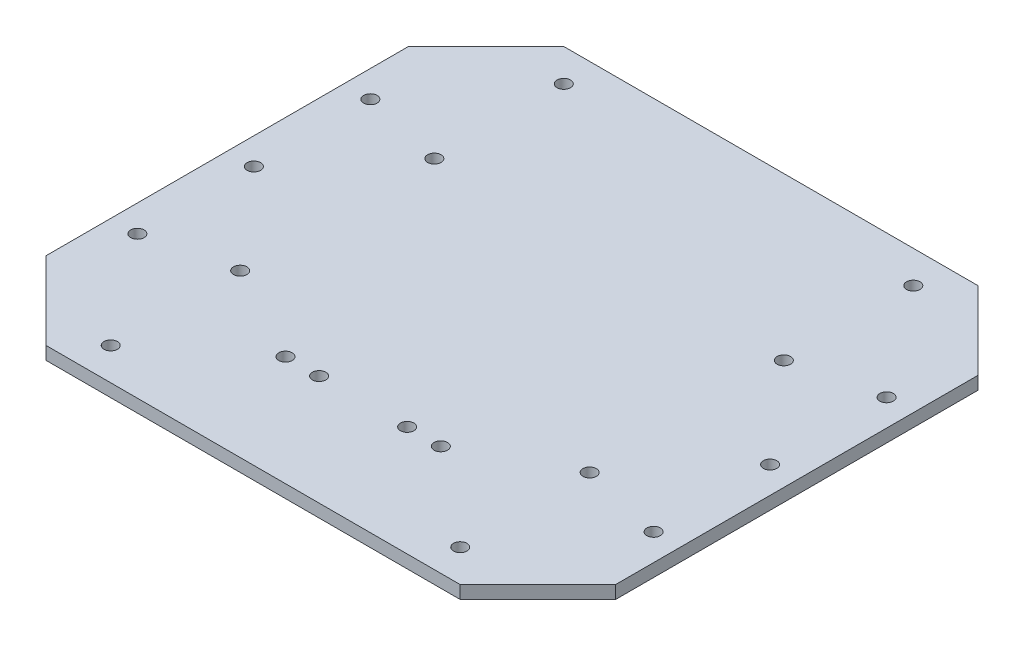
ISO-10303-21;
HEADER;
FILE_DESCRIPTION(('STEP AP214'),'2;1');
FILE_NAME('part.step','',(''),(''),'','','');
FILE_SCHEMA(('AUTOMOTIVE_DESIGN { 1 0 10303 214 1 1 1 1 }'));
ENDSEC;
DATA;
#1=APPLICATION_CONTEXT('core data for automotive mechanical design processes');
#2=APPLICATION_PROTOCOL_DEFINITION('international standard','automotive_design',2000,#1);
#3=PRODUCT_CONTEXT('',#1,'mechanical');
#4=PRODUCT('Part','Part','',(#3));
#5=PRODUCT_RELATED_PRODUCT_CATEGORY('part','',(#4));
#6=PRODUCT_DEFINITION_FORMATION('','',#4);
#7=PRODUCT_DEFINITION_CONTEXT('part definition',#1,'design');
#8=PRODUCT_DEFINITION('design','',#6,#7);
#9=PRODUCT_DEFINITION_SHAPE('','',#8);
#10=(LENGTH_UNIT() NAMED_UNIT(*) SI_UNIT(.MILLI.,.METRE.));
#11=(NAMED_UNIT(*) PLANE_ANGLE_UNIT() SI_UNIT($,.RADIAN.));
#12=(NAMED_UNIT(*) SI_UNIT($,.STERADIAN.) SOLID_ANGLE_UNIT());
#13=UNCERTAINTY_MEASURE_WITH_UNIT(LENGTH_MEASURE(1.E-05),#10,'distance_accuracy_value','');
#14=(GEOMETRIC_REPRESENTATION_CONTEXT(3) GLOBAL_UNCERTAINTY_ASSIGNED_CONTEXT((#13)) GLOBAL_UNIT_ASSIGNED_CONTEXT((#10,
#11,#12)) REPRESENTATION_CONTEXT('',''));
#15=CARTESIAN_POINT('',(0.,0.,0.));
#16=DIRECTION('',(0.,0.,1.));
#17=DIRECTION('',(1.,0.,0.));
#18=AXIS2_PLACEMENT_3D('',#15,#16,#17);
#19=CARTESIAN_POINT('',(0.,6.35,0.));
#20=DIRECTION('',(0.,1.,0.));
#21=DIRECTION('',(0.,0.,1.));
#22=AXIS2_PLACEMENT_3D('',#19,#20,#21);
#23=PLANE('',#22);
#24=CARTESIAN_POINT('',(-85.725,6.35,-111.125));
#25=DIRECTION('',(0.,-1.,0.));
#26=DIRECTION('',(0.,0.,-1.));
#27=AXIS2_PLACEMENT_3D('',#24,#25,#26);
#28=CIRCLE('',#27,3.302);
#29=CARTESIAN_POINT('',(-85.725,6.35,-114.427));
#30=VERTEX_POINT('',#29);
#31=EDGE_CURVE('E326',#30,#30,#28,.T.);
#32=ORIENTED_EDGE('',*,*,#31,.T.);
#33=EDGE_LOOP('',(#32));
#34=FACE_BOUND('',#33,.T.);
#35=CARTESIAN_POINT('',(85.725,6.35,-111.125));
#36=DIRECTION('',(0.,-1.,0.));
#37=DIRECTION('',(0.,0.,-1.));
#38=AXIS2_PLACEMENT_3D('',#35,#36,#37);
#39=CIRCLE('',#38,3.302);
#40=CARTESIAN_POINT('',(85.725,6.35,-114.427));
#41=VERTEX_POINT('',#40);
#42=EDGE_CURVE('E318',#41,#41,#39,.T.);
#43=ORIENTED_EDGE('',*,*,#42,.T.);
#44=EDGE_LOOP('',(#43));
#45=FACE_BOUND('',#44,.T.);
#46=CARTESIAN_POINT('',(85.725,6.35,-47.625));
#47=DIRECTION('',(0.,-1.,0.));
#48=DIRECTION('',(0.,0.,-1.));
#49=AXIS2_PLACEMENT_3D('',#46,#47,#48);
#50=CIRCLE('',#49,3.302);
#51=CARTESIAN_POINT('',(85.725,6.35,-50.927));
#52=VERTEX_POINT('',#51);
#53=EDGE_CURVE('E310',#52,#52,#50,.T.);
#54=ORIENTED_EDGE('',*,*,#53,.T.);
#55=EDGE_LOOP('',(#54));
#56=FACE_BOUND('',#55,.T.);
#57=CARTESIAN_POINT('',(85.725,6.35,47.625));
#58=DIRECTION('',(0.,-1.,0.));
#59=DIRECTION('',(0.,0.,-1.));
#60=AXIS2_PLACEMENT_3D('',#57,#58,#59);
#61=CIRCLE('',#60,3.302);
#62=CARTESIAN_POINT('',(85.725,6.35,44.323));
#63=VERTEX_POINT('',#62);
#64=EDGE_CURVE('E301',#63,#63,#61,.T.);
#65=ORIENTED_EDGE('',*,*,#64,.T.);
#66=EDGE_LOOP('',(#65));
#67=FACE_BOUND('',#66,.T.);
#68=CARTESIAN_POINT('',(85.725,6.35,111.125));
#69=DIRECTION('',(0.,-1.,0.));
#70=DIRECTION('',(0.,0.,-1.));
#71=AXIS2_PLACEMENT_3D('',#68,#69,#70);
#72=CIRCLE('',#71,3.302);
#73=CARTESIAN_POINT('',(85.725,6.35,107.823));
#74=VERTEX_POINT('',#73);
#75=EDGE_CURVE('E349',#74,#74,#72,.T.);
#76=ORIENTED_EDGE('',*,*,#75,.T.);
#77=EDGE_LOOP('',(#76));
#78=FACE_BOUND('',#77,.T.);
#79=CARTESIAN_POINT('',(-85.725,6.35,47.625));
#80=DIRECTION('',(0.,-1.,0.));
#81=DIRECTION('',(0.,0.,-1.));
#82=AXIS2_PLACEMENT_3D('',#79,#80,#81);
#83=CIRCLE('',#82,3.302);
#84=CARTESIAN_POINT('',(-85.725,6.35,44.323));
#85=VERTEX_POINT('',#84);
#86=EDGE_CURVE('E341',#85,#85,#83,.T.);
#87=ORIENTED_EDGE('',*,*,#86,.T.);
#88=EDGE_LOOP('',(#87));
#89=FACE_BOUND('',#88,.T.);
#90=CARTESIAN_POINT('',(-85.725,6.35,-47.625));
#91=DIRECTION('',(0.,-1.,0.));
#92=DIRECTION('',(0.,0.,-1.));
#93=AXIS2_PLACEMENT_3D('',#90,#91,#92);
#94=CIRCLE('',#93,3.302);
#95=CARTESIAN_POINT('',(-85.725,6.35,-50.927));
#96=VERTEX_POINT('',#95);
#97=EDGE_CURVE('E333',#96,#96,#94,.T.);
#98=ORIENTED_EDGE('',*,*,#97,.T.);
#99=EDGE_LOOP('',(#98));
#100=FACE_BOUND('',#99,.T.);
#101=CARTESIAN_POINT('',(-85.725,6.35,111.125));
#102=DIRECTION('',(0.,-1.,0.));
#103=DIRECTION('',(0.,0.,-1.));
#104=AXIS2_PLACEMENT_3D('',#101,#102,#103);
#105=CIRCLE('',#104,3.302);
#106=CARTESIAN_POINT('',(-85.725,6.35,107.823));
#107=VERTEX_POINT('',#106);
#108=EDGE_CURVE('E289',#107,#107,#105,.T.);
#109=ORIENTED_EDGE('',*,*,#108,.T.);
#110=EDGE_LOOP('',(#109));
#111=FACE_BOUND('',#110,.T.);
#112=CARTESIAN_POINT('',(-126.619,6.35,57.15));
#113=DIRECTION('',(0.,1.,0.));
#114=DIRECTION('',(0.,0.,1.));
#115=AXIS2_PLACEMENT_3D('',#112,#113,#114);
#116=CIRCLE('',#115,3.302);
#117=CARTESIAN_POINT('',(-126.619,6.35,60.452));
#118=VERTEX_POINT('',#117);
#119=EDGE_CURVE('E249',#118,#118,#116,.T.);
#120=ORIENTED_EDGE('',*,*,#119,.F.);
#121=EDGE_LOOP('',(#120));
#122=FACE_BOUND('',#121,.T.);
#123=CARTESIAN_POINT('',(126.619,6.35,57.15));
#124=DIRECTION('',(0.,1.,0.));
#125=DIRECTION('',(0.,0.,1.));
#126=AXIS2_PLACEMENT_3D('',#123,#124,#125);
#127=CIRCLE('',#126,3.30200000000001);
#128=CARTESIAN_POINT('',(126.619,6.35,60.452));
#129=VERTEX_POINT('',#128);
#130=EDGE_CURVE('E274',#129,#129,#127,.T.);
#131=ORIENTED_EDGE('',*,*,#130,.F.);
#132=EDGE_LOOP('',(#131));
#133=FACE_BOUND('',#132,.T.);
#134=CARTESIAN_POINT('',(126.619,6.35,0.));
#135=DIRECTION('',(0.,1.,0.));
#136=DIRECTION('',(0.,0.,1.));
#137=AXIS2_PLACEMENT_3D('',#134,#135,#136);
#138=CIRCLE('',#137,3.30200000000001);
#139=CARTESIAN_POINT('',(126.619,6.35,3.30199999999996));
#140=VERTEX_POINT('',#139);
#141=EDGE_CURVE('E266',#140,#140,#138,.T.);
#142=ORIENTED_EDGE('',*,*,#141,.F.);
#143=EDGE_LOOP('',(#142));
#144=FACE_BOUND('',#143,.T.);
#145=CARTESIAN_POINT('',(126.619,6.35,-57.15));
#146=DIRECTION('',(0.,1.,0.));
#147=DIRECTION('',(0.,0.,1.));
#148=AXIS2_PLACEMENT_3D('',#145,#146,#147);
#149=CIRCLE('',#148,3.30200000000001);
#150=CARTESIAN_POINT('',(126.619,6.35,-53.848));
#151=VERTEX_POINT('',#150);
#152=EDGE_CURVE('E257',#151,#151,#149,.T.);
#153=ORIENTED_EDGE('',*,*,#152,.F.);
#154=EDGE_LOOP('',(#153));
#155=FACE_BOUND('',#154,.T.);
#156=CARTESIAN_POINT('',(-126.619,6.35,0.));
#157=DIRECTION('',(0.,1.,0.));
#158=DIRECTION('',(0.,0.,1.));
#159=AXIS2_PLACEMENT_3D('',#156,#157,#158);
#160=CIRCLE('',#159,3.302);
#161=CARTESIAN_POINT('',(-126.619,6.35,3.302));
#162=VERTEX_POINT('',#161);
#163=EDGE_CURVE('E258',#162,#162,#160,.T.);
#164=ORIENTED_EDGE('',*,*,#163,.F.);
#165=EDGE_LOOP('',(#164));
#166=FACE_BOUND('',#165,.T.);
#167=CARTESIAN_POINT('',(-126.619,6.35,-57.15));
#168=DIRECTION('',(0.,1.,0.));
#169=DIRECTION('',(0.,0.,1.));
#170=AXIS2_PLACEMENT_3D('',#167,#168,#169);
#171=CIRCLE('',#170,3.302);
#172=CARTESIAN_POINT('',(-126.619,6.35,-53.848));
#173=VERTEX_POINT('',#172);
#174=EDGE_CURVE('E245',#173,#173,#171,.T.);
#175=ORIENTED_EDGE('',*,*,#174,.F.);
#176=EDGE_LOOP('',(#175));
#177=FACE_BOUND('',#176,.T.);
#178=CARTESIAN_POINT('',(21.59,6.35,73.025));
#179=DIRECTION('',(0.,1.,0.));
#180=DIRECTION('',(0.,0.,1.));
#181=AXIS2_PLACEMENT_3D('',#178,#179,#180);
#182=CIRCLE('',#181,3.302);
#183=CARTESIAN_POINT('',(21.59,6.35,76.327));
#184=VERTEX_POINT('',#183);
#185=EDGE_CURVE('E225',#184,#184,#182,.T.);
#186=ORIENTED_EDGE('',*,*,#185,.F.);
#187=EDGE_LOOP('',(#186));
#188=FACE_BOUND('',#187,.T.);
#189=CARTESIAN_POINT('',(-38.1,6.35,73.025));
#190=DIRECTION('',(0.,1.,0.));
#191=DIRECTION('',(0.,0.,1.));
#192=AXIS2_PLACEMENT_3D('',#189,#190,#191);
#193=CIRCLE('',#192,3.302);
#194=CARTESIAN_POINT('',(-38.1,6.35,76.327));
#195=VERTEX_POINT('',#194);
#196=EDGE_CURVE('E150',#195,#195,#193,.T.);
#197=ORIENTED_EDGE('',*,*,#196,.F.);
#198=EDGE_LOOP('',(#197));
#199=FACE_BOUND('',#198,.T.);
#200=DIRECTION('',(0.707106781186546,0.,0.707106781186549));
#201=VECTOR('',#200,1.);
#202=CARTESIAN_POINT('',(-139.7,6.35,88.9));
#203=LINE('',#202,#201);
#204=CARTESIAN_POINT('',(-139.7,6.35,88.9));
#205=VERTEX_POINT('',#204);
#206=CARTESIAN_POINT('',(-101.6,6.35,127.));
#207=VERTEX_POINT('',#206);
#208=EDGE_CURVE('E168',#205,#207,#203,.T.);
#209=ORIENTED_EDGE('',*,*,#208,.T.);
#210=DIRECTION('',(1.,0.,0.));
#211=VECTOR('',#210,1.);
#212=CARTESIAN_POINT('',(-101.6,6.35,127.));
#213=LINE('',#212,#211);
#214=CARTESIAN_POINT('',(101.6,6.35,127.));
#215=VERTEX_POINT('',#214);
#216=EDGE_CURVE('E104',#207,#215,#213,.T.);
#217=ORIENTED_EDGE('',*,*,#216,.T.);
#218=DIRECTION('',(0.707106781186547,0.,-0.707106781186548));
#219=VECTOR('',#218,1.);
#220=CARTESIAN_POINT('',(101.6,6.35,127.));
#221=LINE('',#220,#219);
#222=CARTESIAN_POINT('',(139.7,6.35,88.9));
#223=VERTEX_POINT('',#222);
#224=EDGE_CURVE('E189',#215,#223,#221,.T.);
#225=ORIENTED_EDGE('',*,*,#224,.T.);
#226=DIRECTION('',(0.,0.,-1.));
#227=VECTOR('',#226,1.);
#228=CARTESIAN_POINT('',(139.7,6.35,88.9));
#229=LINE('',#228,#227);
#230=CARTESIAN_POINT('',(139.7,6.35,-88.9));
#231=VERTEX_POINT('',#230);
#232=EDGE_CURVE('E203',#223,#231,#229,.T.);
#233=ORIENTED_EDGE('',*,*,#232,.T.);
#234=DIRECTION('',(-0.707106781186547,0.,-0.707106781186548));
#235=VECTOR('',#234,1.);
#236=CARTESIAN_POINT('',(101.6,6.35,-127.));
#237=LINE('',#236,#235);
#238=CARTESIAN_POINT('',(101.6,6.35,-127.));
#239=VERTEX_POINT('',#238);
#240=EDGE_CURVE('E123',#231,#239,#237,.T.);
#241=ORIENTED_EDGE('',*,*,#240,.T.);
#242=DIRECTION('',(-1.,0.,0.));
#243=VECTOR('',#242,1.);
#244=CARTESIAN_POINT('',(-101.6,6.35,-127.));
#245=LINE('',#244,#243);
#246=CARTESIAN_POINT('',(-101.6,6.35,-127.));
#247=VERTEX_POINT('',#246);
#248=EDGE_CURVE('E117',#239,#247,#245,.T.);
#249=ORIENTED_EDGE('',*,*,#248,.T.);
#250=DIRECTION('',(-0.707106781186546,0.,0.707106781186549));
#251=VECTOR('',#250,1.);
#252=CARTESIAN_POINT('',(-139.7,6.35,-88.9));
#253=LINE('',#252,#251);
#254=CARTESIAN_POINT('',(-139.7,6.35,-88.9));
#255=VERTEX_POINT('',#254);
#256=EDGE_CURVE('E121',#247,#255,#253,.T.);
#257=ORIENTED_EDGE('',*,*,#256,.T.);
#258=DIRECTION('',(0.,0.,1.));
#259=VECTOR('',#258,1.);
#260=CARTESIAN_POINT('',(-139.7,6.35,88.9));
#261=LINE('',#260,#259);
#262=EDGE_CURVE('E61',#255,#205,#261,.T.);
#263=ORIENTED_EDGE('',*,*,#262,.T.);
#264=EDGE_LOOP('',(#209,#217,#225,#233,#241,#249,#257,#263));
#265=FACE_BOUND('',#264,.T.);
#266=CARTESIAN_POINT('',(38.1,6.35,73.025));
#267=DIRECTION('',(0.,1.,0.));
#268=DIRECTION('',(0.,0.,-1.));
#269=AXIS2_PLACEMENT_3D('',#266,#267,#268);
#270=CIRCLE('',#269,3.302);
#271=CARTESIAN_POINT('',(38.1,6.35,69.723));
#272=VERTEX_POINT('',#271);
#273=EDGE_CURVE('E217',#272,#272,#270,.T.);
#274=ORIENTED_EDGE('',*,*,#273,.F.);
#275=EDGE_LOOP('',(#274));
#276=FACE_BOUND('',#275,.T.);
#277=CARTESIAN_POINT('',(-21.59,6.35,73.025));
#278=DIRECTION('',(0.,1.,0.));
#279=DIRECTION('',(0.,0.,-1.));
#280=AXIS2_PLACEMENT_3D('',#277,#278,#279);
#281=CIRCLE('',#280,3.302);
#282=CARTESIAN_POINT('',(-21.59,6.35,69.723));
#283=VERTEX_POINT('',#282);
#284=EDGE_CURVE('E233',#283,#283,#281,.T.);
#285=ORIENTED_EDGE('',*,*,#284,.F.);
#286=EDGE_LOOP('',(#285));
#287=FACE_BOUND('',#286,.T.);
#288=ADVANCED_FACE('F43',(#34,#45,#56,#67,#78,#89,#100,#111,#122,#133,#144,#155,#166,#177,#188,
#199,#265,#276,#287),#23,.T.);
#289=CARTESIAN_POINT('',(0.,0.,0.));
#290=DIRECTION('',(0.,1.,0.));
#291=DIRECTION('',(0.,0.,1.));
#292=AXIS2_PLACEMENT_3D('',#289,#290,#291);
#293=PLANE('',#292);
#294=CARTESIAN_POINT('',(-85.725,0.,-111.125));
#295=DIRECTION('',(0.,-1.,0.));
#296=DIRECTION('',(0.,0.,-1.));
#297=AXIS2_PLACEMENT_3D('',#294,#295,#296);
#298=CIRCLE('',#297,3.302);
#299=CARTESIAN_POINT('',(-85.725,0.,-114.427));
#300=VERTEX_POINT('',#299);
#301=EDGE_CURVE('E297',#300,#300,#298,.T.);
#302=ORIENTED_EDGE('',*,*,#301,.F.);
#303=EDGE_LOOP('',(#302));
#304=FACE_BOUND('',#303,.T.);
#305=CARTESIAN_POINT('',(85.725,0.,-111.125));
#306=DIRECTION('',(0.,-1.,0.));
#307=DIRECTION('',(0.,0.,-1.));
#308=AXIS2_PLACEMENT_3D('',#305,#306,#307);
#309=CIRCLE('',#308,3.302);
#310=CARTESIAN_POINT('',(85.725,0.,-114.427));
#311=VERTEX_POINT('',#310);
#312=EDGE_CURVE('E322',#311,#311,#309,.T.);
#313=ORIENTED_EDGE('',*,*,#312,.F.);
#314=EDGE_LOOP('',(#313));
#315=FACE_BOUND('',#314,.T.);
#316=CARTESIAN_POINT('',(85.725,0.,-47.625));
#317=DIRECTION('',(0.,-1.,0.));
#318=DIRECTION('',(0.,0.,-1.));
#319=AXIS2_PLACEMENT_3D('',#316,#317,#318);
#320=CIRCLE('',#319,3.302);
#321=CARTESIAN_POINT('',(85.725,0.,-50.927));
#322=VERTEX_POINT('',#321);
#323=EDGE_CURVE('E314',#322,#322,#320,.T.);
#324=ORIENTED_EDGE('',*,*,#323,.F.);
#325=EDGE_LOOP('',(#324));
#326=FACE_BOUND('',#325,.T.);
#327=CARTESIAN_POINT('',(85.725,0.,47.625));
#328=DIRECTION('',(0.,-1.,0.));
#329=DIRECTION('',(0.,0.,-1.));
#330=AXIS2_PLACEMENT_3D('',#327,#328,#329);
#331=CIRCLE('',#330,3.302);
#332=CARTESIAN_POINT('',(85.725,0.,44.323));
#333=VERTEX_POINT('',#332);
#334=EDGE_CURVE('E305',#333,#333,#331,.T.);
#335=ORIENTED_EDGE('',*,*,#334,.F.);
#336=EDGE_LOOP('',(#335));
#337=FACE_BOUND('',#336,.T.);
#338=CARTESIAN_POINT('',(85.725,0.,111.125));
#339=DIRECTION('',(0.,-1.,0.));
#340=DIRECTION('',(0.,0.,-1.));
#341=AXIS2_PLACEMENT_3D('',#338,#339,#340);
#342=CIRCLE('',#341,3.302);
#343=CARTESIAN_POINT('',(85.725,0.,107.823));
#344=VERTEX_POINT('',#343);
#345=EDGE_CURVE('E306',#344,#344,#342,.T.);
#346=ORIENTED_EDGE('',*,*,#345,.F.);
#347=EDGE_LOOP('',(#346));
#348=FACE_BOUND('',#347,.T.);
#349=CARTESIAN_POINT('',(-85.725,0.,47.625));
#350=DIRECTION('',(0.,-1.,0.));
#351=DIRECTION('',(0.,0.,-1.));
#352=AXIS2_PLACEMENT_3D('',#349,#350,#351);
#353=CIRCLE('',#352,3.302);
#354=CARTESIAN_POINT('',(-85.725,0.,44.323));
#355=VERTEX_POINT('',#354);
#356=EDGE_CURVE('E345',#355,#355,#353,.T.);
#357=ORIENTED_EDGE('',*,*,#356,.F.);
#358=EDGE_LOOP('',(#357));
#359=FACE_BOUND('',#358,.T.);
#360=CARTESIAN_POINT('',(-85.725,0.,-47.625));
#361=DIRECTION('',(0.,-1.,0.));
#362=DIRECTION('',(0.,0.,-1.));
#363=AXIS2_PLACEMENT_3D('',#360,#361,#362);
#364=CIRCLE('',#363,3.302);
#365=CARTESIAN_POINT('',(-85.725,0.,-50.927));
#366=VERTEX_POINT('',#365);
#367=EDGE_CURVE('E337',#366,#366,#364,.T.);
#368=ORIENTED_EDGE('',*,*,#367,.F.);
#369=EDGE_LOOP('',(#368));
#370=FACE_BOUND('',#369,.T.);
#371=CARTESIAN_POINT('',(-85.725,0.,111.125));
#372=DIRECTION('',(0.,-1.,0.));
#373=DIRECTION('',(0.,0.,-1.));
#374=AXIS2_PLACEMENT_3D('',#371,#372,#373);
#375=CIRCLE('',#374,3.302);
#376=CARTESIAN_POINT('',(-85.725,0.,107.823));
#377=VERTEX_POINT('',#376);
#378=EDGE_CURVE('E293',#377,#377,#375,.T.);
#379=ORIENTED_EDGE('',*,*,#378,.F.);
#380=EDGE_LOOP('',(#379));
#381=FACE_BOUND('',#380,.T.);
#382=CARTESIAN_POINT('',(-126.619,0.,57.15));
#383=DIRECTION('',(0.,1.,0.));
#384=DIRECTION('',(0.,0.,1.));
#385=AXIS2_PLACEMENT_3D('',#382,#383,#384);
#386=CIRCLE('',#385,3.302);
#387=CARTESIAN_POINT('',(-126.619,0.,60.452));
#388=VERTEX_POINT('',#387);
#389=EDGE_CURVE('E278',#388,#388,#386,.T.);
#390=ORIENTED_EDGE('',*,*,#389,.T.);
#391=EDGE_LOOP('',(#390));
#392=FACE_BOUND('',#391,.T.);
#393=CARTESIAN_POINT('',(126.619,0.,57.15));
#394=DIRECTION('',(0.,1.,0.));
#395=DIRECTION('',(0.,0.,1.));
#396=AXIS2_PLACEMENT_3D('',#393,#394,#395);
#397=CIRCLE('',#396,3.30200000000001);
#398=CARTESIAN_POINT('',(126.619,0.,60.452));
#399=VERTEX_POINT('',#398);
#400=EDGE_CURVE('E270',#399,#399,#397,.T.);
#401=ORIENTED_EDGE('',*,*,#400,.T.);
#402=EDGE_LOOP('',(#401));
#403=FACE_BOUND('',#402,.T.);
#404=CARTESIAN_POINT('',(126.619,0.,0.));
#405=DIRECTION('',(0.,1.,0.));
#406=DIRECTION('',(0.,0.,1.));
#407=AXIS2_PLACEMENT_3D('',#404,#405,#406);
#408=CIRCLE('',#407,3.30200000000001);
#409=CARTESIAN_POINT('',(126.619,0.,3.30199999999996));
#410=VERTEX_POINT('',#409);
#411=EDGE_CURVE('E262',#410,#410,#408,.T.);
#412=ORIENTED_EDGE('',*,*,#411,.T.);
#413=EDGE_LOOP('',(#412));
#414=FACE_BOUND('',#413,.T.);
#415=CARTESIAN_POINT('',(126.619,0.,-57.15));
#416=DIRECTION('',(0.,1.,0.));
#417=DIRECTION('',(0.,0.,1.));
#418=AXIS2_PLACEMENT_3D('',#415,#416,#417);
#419=CIRCLE('',#418,3.30200000000001);
#420=CARTESIAN_POINT('',(126.619,0.,-53.848));
#421=VERTEX_POINT('',#420);
#422=EDGE_CURVE('E253',#421,#421,#419,.T.);
#423=ORIENTED_EDGE('',*,*,#422,.T.);
#424=EDGE_LOOP('',(#423));
#425=FACE_BOUND('',#424,.T.);
#426=CARTESIAN_POINT('',(-126.619,0.,0.));
#427=DIRECTION('',(0.,1.,0.));
#428=DIRECTION('',(0.,0.,1.));
#429=AXIS2_PLACEMENT_3D('',#426,#427,#428);
#430=CIRCLE('',#429,3.302);
#431=CARTESIAN_POINT('',(-126.619,0.,3.302));
#432=VERTEX_POINT('',#431);
#433=EDGE_CURVE('E285',#432,#432,#430,.T.);
#434=ORIENTED_EDGE('',*,*,#433,.T.);
#435=EDGE_LOOP('',(#434));
#436=FACE_BOUND('',#435,.T.);
#437=CARTESIAN_POINT('',(-126.619,0.,-57.15));
#438=DIRECTION('',(0.,1.,0.));
#439=DIRECTION('',(0.,0.,1.));
#440=AXIS2_PLACEMENT_3D('',#437,#438,#439);
#441=CIRCLE('',#440,3.302);
#442=CARTESIAN_POINT('',(-126.619,0.,-53.848));
#443=VERTEX_POINT('',#442);
#444=EDGE_CURVE('E241',#443,#443,#441,.T.);
#445=ORIENTED_EDGE('',*,*,#444,.T.);
#446=EDGE_LOOP('',(#445));
#447=FACE_BOUND('',#446,.T.);
#448=DIRECTION('',(0.707106781186546,0.,0.707106781186549));
#449=VECTOR('',#448,1.);
#450=CARTESIAN_POINT('',(-139.7,0.,88.9));
#451=LINE('',#450,#449);
#452=CARTESIAN_POINT('',(-139.7,0.,88.9));
#453=VERTEX_POINT('',#452);
#454=CARTESIAN_POINT('',(-101.6,0.,127.));
#455=VERTEX_POINT('',#454);
#456=EDGE_CURVE('E145',#453,#455,#451,.T.);
#457=ORIENTED_EDGE('',*,*,#456,.F.);
#458=DIRECTION('',(0.,0.,1.));
#459=VECTOR('',#458,1.);
#460=CARTESIAN_POINT('',(-139.7,0.,88.9));
#461=LINE('',#460,#459);
#462=CARTESIAN_POINT('',(-139.7,0.,-88.9));
#463=VERTEX_POINT('',#462);
#464=EDGE_CURVE('E96',#463,#453,#461,.T.);
#465=ORIENTED_EDGE('',*,*,#464,.F.);
#466=DIRECTION('',(-0.707106781186546,0.,0.707106781186549));
#467=VECTOR('',#466,1.);
#468=CARTESIAN_POINT('',(-139.7,0.,-88.9));
#469=LINE('',#468,#467);
#470=CARTESIAN_POINT('',(-101.6,0.,-127.));
#471=VERTEX_POINT('',#470);
#472=EDGE_CURVE('E90',#471,#463,#469,.T.);
#473=ORIENTED_EDGE('',*,*,#472,.F.);
#474=DIRECTION('',(-1.,0.,0.));
#475=VECTOR('',#474,1.);
#476=CARTESIAN_POINT('',(-101.6,0.,-127.));
#477=LINE('',#476,#475);
#478=CARTESIAN_POINT('',(101.6,0.,-127.));
#479=VERTEX_POINT('',#478);
#480=EDGE_CURVE('E132',#479,#471,#477,.T.);
#481=ORIENTED_EDGE('',*,*,#480,.F.);
#482=DIRECTION('',(-0.707106781186547,0.,-0.707106781186548));
#483=VECTOR('',#482,1.);
#484=CARTESIAN_POINT('',(101.6,0.,-127.));
#485=LINE('',#484,#483);
#486=CARTESIAN_POINT('',(139.7,0.,-88.9));
#487=VERTEX_POINT('',#486);
#488=EDGE_CURVE('E159',#487,#479,#485,.T.);
#489=ORIENTED_EDGE('',*,*,#488,.F.);
#490=DIRECTION('',(0.,0.,-1.));
#491=VECTOR('',#490,1.);
#492=CARTESIAN_POINT('',(139.7,0.,88.9));
#493=LINE('',#492,#491);
#494=CARTESIAN_POINT('',(139.7,0.,88.9));
#495=VERTEX_POINT('',#494);
#496=EDGE_CURVE('E156',#495,#487,#493,.T.);
#497=ORIENTED_EDGE('',*,*,#496,.F.);
#498=DIRECTION('',(0.707106781186547,0.,-0.707106781186548));
#499=VECTOR('',#498,1.);
#500=CARTESIAN_POINT('',(101.6,0.,127.));
#501=LINE('',#500,#499);
#502=CARTESIAN_POINT('',(101.6,0.,127.));
#503=VERTEX_POINT('',#502);
#504=EDGE_CURVE('E153',#503,#495,#501,.T.);
#505=ORIENTED_EDGE('',*,*,#504,.F.);
#506=DIRECTION('',(1.,0.,0.));
#507=VECTOR('',#506,1.);
#508=CARTESIAN_POINT('',(-101.6,0.,127.));
#509=LINE('',#508,#507);
#510=EDGE_CURVE('E149',#455,#503,#509,.T.);
#511=ORIENTED_EDGE('',*,*,#510,.F.);
#512=EDGE_LOOP('',(#457,#465,#473,#481,#489,#497,#505,#511));
#513=FACE_BOUND('',#512,.T.);
#514=CARTESIAN_POINT('',(-38.1,0.,73.025));
#515=DIRECTION('',(0.,1.,0.));
#516=DIRECTION('',(0.,0.,1.));
#517=AXIS2_PLACEMENT_3D('',#514,#515,#516);
#518=CIRCLE('',#517,3.302);
#519=CARTESIAN_POINT('',(-38.1,0.,76.327));
#520=VERTEX_POINT('',#519);
#521=EDGE_CURVE('E213',#520,#520,#518,.T.);
#522=ORIENTED_EDGE('',*,*,#521,.T.);
#523=EDGE_LOOP('',(#522));
#524=FACE_BOUND('',#523,.T.);
#525=CARTESIAN_POINT('',(38.1,0.,73.025));
#526=DIRECTION('',(0.,1.,0.));
#527=DIRECTION('',(0.,0.,-1.));
#528=AXIS2_PLACEMENT_3D('',#525,#526,#527);
#529=CIRCLE('',#528,3.302);
#530=CARTESIAN_POINT('',(38.1,0.,69.723));
#531=VERTEX_POINT('',#530);
#532=EDGE_CURVE('E221',#531,#531,#529,.T.);
#533=ORIENTED_EDGE('',*,*,#532,.T.);
#534=EDGE_LOOP('',(#533));
#535=FACE_BOUND('',#534,.T.);
#536=CARTESIAN_POINT('',(21.59,0.,73.025));
#537=DIRECTION('',(0.,1.,0.));
#538=DIRECTION('',(0.,0.,1.));
#539=AXIS2_PLACEMENT_3D('',#536,#537,#538);
#540=CIRCLE('',#539,3.302);
#541=CARTESIAN_POINT('',(21.59,0.,76.327));
#542=VERTEX_POINT('',#541);
#543=EDGE_CURVE('E229',#542,#542,#540,.T.);
#544=ORIENTED_EDGE('',*,*,#543,.T.);
#545=EDGE_LOOP('',(#544));
#546=FACE_BOUND('',#545,.T.);
#547=CARTESIAN_POINT('',(-21.59,0.,73.025));
#548=DIRECTION('',(0.,1.,0.));
#549=DIRECTION('',(0.,0.,-1.));
#550=AXIS2_PLACEMENT_3D('',#547,#548,#549);
#551=CIRCLE('',#550,3.302);
#552=CARTESIAN_POINT('',(-21.59,0.,69.723));
#553=VERTEX_POINT('',#552);
#554=EDGE_CURVE('E237',#553,#553,#551,.T.);
#555=ORIENTED_EDGE('',*,*,#554,.T.);
#556=EDGE_LOOP('',(#555));
#557=FACE_BOUND('',#556,.T.);
#558=ADVANCED_FACE('F193',(#304,#315,#326,#337,#348,#359,#370,#381,#392,#403,#414,#425,#436,
#447,#513,#524,#535,#546,#557),#293,.F.);
#559=CARTESIAN_POINT('',(-139.7,6.35,88.9));
#560=DIRECTION('',(0.707106781186549,0.,-0.707106781186546));
#561=DIRECTION('',(-0.707106781186546,0.,-0.707106781186549));
#562=AXIS2_PLACEMENT_3D('',#559,#560,#561);
#563=PLANE('',#562);
#564=ORIENTED_EDGE('',*,*,#456,.T.);
#565=DIRECTION('',(0.,-1.,0.));
#566=VECTOR('',#565,1.);
#567=CARTESIAN_POINT('',(-101.6,6.35,127.));
#568=LINE('',#567,#566);
#569=EDGE_CURVE('E11',#207,#455,#568,.T.);
#570=ORIENTED_EDGE('',*,*,#569,.F.);
#571=ORIENTED_EDGE('',*,*,#208,.F.);
#572=DIRECTION('',(0.,-1.,0.));
#573=VECTOR('',#572,1.);
#574=CARTESIAN_POINT('',(-139.7,6.35,88.9));
#575=LINE('',#574,#573);
#576=EDGE_CURVE('E141',#205,#453,#575,.T.);
#577=ORIENTED_EDGE('',*,*,#576,.T.);
#578=EDGE_LOOP('',(#564,#570,#571,#577));
#579=FACE_BOUND('',#578,.T.);
#580=ADVANCED_FACE('F45',(#579),#563,.F.);
#581=CARTESIAN_POINT('',(-101.6,6.35,127.));
#582=DIRECTION('',(0.,0.,-1.));
#583=DIRECTION('',(-1.,0.,0.));
#584=AXIS2_PLACEMENT_3D('',#581,#582,#583);
#585=PLANE('',#584);
#586=ORIENTED_EDGE('',*,*,#510,.T.);
#587=DIRECTION('',(0.,-1.,0.));
#588=VECTOR('',#587,1.);
#589=CARTESIAN_POINT('',(101.6,6.35,127.));
#590=LINE('',#589,#588);
#591=EDGE_CURVE('E53',#215,#503,#590,.T.);
#592=ORIENTED_EDGE('',*,*,#591,.F.);
#593=ORIENTED_EDGE('',*,*,#216,.F.);
#594=ORIENTED_EDGE('',*,*,#569,.T.);
#595=EDGE_LOOP('',(#586,#592,#593,#594));
#596=FACE_BOUND('',#595,.T.);
#597=ADVANCED_FACE('F436',(#596),#585,.F.);
#598=CARTESIAN_POINT('',(101.6,6.35,127.));
#599=DIRECTION('',(-0.707106781186548,0.,-0.707106781186547));
#600=DIRECTION('',(-0.707106781186547,0.,0.707106781186548));
#601=AXIS2_PLACEMENT_3D('',#598,#599,#600);
#602=PLANE('',#601);
#603=ORIENTED_EDGE('',*,*,#504,.T.);
#604=DIRECTION('',(0.,-1.,0.));
#605=VECTOR('',#604,1.);
#606=CARTESIAN_POINT('',(139.7,6.35,88.9));
#607=LINE('',#606,#605);
#608=EDGE_CURVE('E179',#223,#495,#607,.T.);
#609=ORIENTED_EDGE('',*,*,#608,.F.);
#610=ORIENTED_EDGE('',*,*,#224,.F.);
#611=ORIENTED_EDGE('',*,*,#591,.T.);
#612=EDGE_LOOP('',(#603,#609,#610,#611));
#613=FACE_BOUND('',#612,.T.);
#614=ADVANCED_FACE('F187',(#613),#602,.F.);
#615=CARTESIAN_POINT('',(139.7,6.35,88.9));
#616=DIRECTION('',(-1.,0.,0.));
#617=DIRECTION('',(0.,0.,1.));
#618=AXIS2_PLACEMENT_3D('',#615,#616,#617);
#619=PLANE('',#618);
#620=ORIENTED_EDGE('',*,*,#496,.T.);
#621=DIRECTION('',(0.,-1.,0.));
#622=VECTOR('',#621,1.);
#623=CARTESIAN_POINT('',(139.7,6.35,-88.9));
#624=LINE('',#623,#622);
#625=EDGE_CURVE('E175',#231,#487,#624,.T.);
#626=ORIENTED_EDGE('',*,*,#625,.F.);
#627=ORIENTED_EDGE('',*,*,#232,.F.);
#628=ORIENTED_EDGE('',*,*,#608,.T.);
#629=EDGE_LOOP('',(#620,#626,#627,#628));
#630=FACE_BOUND('',#629,.T.);
#631=ADVANCED_FACE('F198',(#630),#619,.F.);
#632=CARTESIAN_POINT('',(101.6,6.35,-127.));
#633=DIRECTION('',(-0.707106781186548,0.,0.707106781186547));
#634=DIRECTION('',(0.707106781186547,0.,0.707106781186548));
#635=AXIS2_PLACEMENT_3D('',#632,#633,#634);
#636=PLANE('',#635);
#637=ORIENTED_EDGE('',*,*,#488,.T.);
#638=DIRECTION('',(0.,-1.,0.));
#639=VECTOR('',#638,1.);
#640=CARTESIAN_POINT('',(101.6,6.35,-127.));
#641=LINE('',#640,#639);
#642=EDGE_CURVE('E134',#239,#479,#641,.T.);
#643=ORIENTED_EDGE('',*,*,#642,.F.);
#644=ORIENTED_EDGE('',*,*,#240,.F.);
#645=ORIENTED_EDGE('',*,*,#625,.T.);
#646=EDGE_LOOP('',(#637,#643,#644,#645));
#647=FACE_BOUND('',#646,.T.);
#648=ADVANCED_FACE('F201',(#647),#636,.F.);
#649=CARTESIAN_POINT('',(-101.6,6.35,-127.));
#650=DIRECTION('',(0.,0.,1.));
#651=DIRECTION('',(1.,0.,0.));
#652=AXIS2_PLACEMENT_3D('',#649,#650,#651);
#653=PLANE('',#652);
#654=ORIENTED_EDGE('',*,*,#480,.T.);
#655=DIRECTION('',(0.,-1.,0.));
#656=VECTOR('',#655,1.);
#657=CARTESIAN_POINT('',(-101.6,6.35,-127.));
#658=LINE('',#657,#656);
#659=EDGE_CURVE('E129',#247,#471,#658,.T.);
#660=ORIENTED_EDGE('',*,*,#659,.F.);
#661=ORIENTED_EDGE('',*,*,#248,.F.);
#662=ORIENTED_EDGE('',*,*,#642,.T.);
#663=EDGE_LOOP('',(#654,#660,#661,#662));
#664=FACE_BOUND('',#663,.T.);
#665=ADVANCED_FACE('F130',(#664),#653,.F.);
#666=CARTESIAN_POINT('',(-139.7,6.35,-88.9));
#667=DIRECTION('',(0.707106781186549,0.,0.707106781186546));
#668=DIRECTION('',(0.707106781186546,0.,-0.707106781186549));
#669=AXIS2_PLACEMENT_3D('',#666,#667,#668);
#670=PLANE('',#669);
#671=ORIENTED_EDGE('',*,*,#472,.T.);
#672=DIRECTION('',(0.,-1.,0.));
#673=VECTOR('',#672,1.);
#674=CARTESIAN_POINT('',(-139.7,6.35,-88.9));
#675=LINE('',#674,#673);
#676=EDGE_CURVE('E135',#255,#463,#675,.T.);
#677=ORIENTED_EDGE('',*,*,#676,.F.);
#678=ORIENTED_EDGE('',*,*,#256,.F.);
#679=ORIENTED_EDGE('',*,*,#659,.T.);
#680=EDGE_LOOP('',(#671,#677,#678,#679));
#681=FACE_BOUND('',#680,.T.);
#682=ADVANCED_FACE('F137',(#681),#670,.F.);
#683=CARTESIAN_POINT('',(-139.7,6.35,88.9));
#684=DIRECTION('',(1.,0.,0.));
#685=DIRECTION('',(0.,0.,-1.));
#686=AXIS2_PLACEMENT_3D('',#683,#684,#685);
#687=PLANE('',#686);
#688=ORIENTED_EDGE('',*,*,#464,.T.);
#689=ORIENTED_EDGE('',*,*,#576,.F.);
#690=ORIENTED_EDGE('',*,*,#262,.F.);
#691=ORIENTED_EDGE('',*,*,#676,.T.);
#692=EDGE_LOOP('',(#688,#689,#690,#691));
#693=FACE_BOUND('',#692,.T.);
#694=ADVANCED_FACE('F401',(#693),#687,.F.);
#695=CARTESIAN_POINT('',(-38.1,6.35,73.025));
#696=DIRECTION('',(0.,-1.,0.));
#697=DIRECTION('',(0.,0.,-1.));
#698=AXIS2_PLACEMENT_3D('',#695,#696,#697);
#699=CYLINDRICAL_SURFACE('',#698,3.302);
#700=ORIENTED_EDGE('',*,*,#196,.T.);
#701=EDGE_LOOP('',(#700));
#702=FACE_BOUND('',#701,.T.);
#703=ORIENTED_EDGE('',*,*,#521,.F.);
#704=EDGE_LOOP('',(#703));
#705=FACE_BOUND('',#704,.T.);
#706=ADVANCED_FACE('F397',(#702,#705),#699,.F.);
#707=CARTESIAN_POINT('',(38.1,6.35,73.025));
#708=DIRECTION('',(0.,-1.,0.));
#709=DIRECTION('',(0.,0.,-1.));
#710=AXIS2_PLACEMENT_3D('',#707,#708,#709);
#711=CYLINDRICAL_SURFACE('',#710,3.302);
#712=ORIENTED_EDGE('',*,*,#273,.T.);
#713=EDGE_LOOP('',(#712));
#714=FACE_BOUND('',#713,.T.);
#715=ORIENTED_EDGE('',*,*,#532,.F.);
#716=EDGE_LOOP('',(#715));
#717=FACE_BOUND('',#716,.T.);
#718=ADVANCED_FACE('F400',(#714,#717),#711,.F.);
#719=CARTESIAN_POINT('',(21.59,6.35,73.025));
#720=DIRECTION('',(0.,-1.,0.));
#721=DIRECTION('',(0.,0.,-1.));
#722=AXIS2_PLACEMENT_3D('',#719,#720,#721);
#723=CYLINDRICAL_SURFACE('',#722,3.302);
#724=ORIENTED_EDGE('',*,*,#185,.T.);
#725=EDGE_LOOP('',(#724));
#726=FACE_BOUND('',#725,.T.);
#727=ORIENTED_EDGE('',*,*,#543,.F.);
#728=EDGE_LOOP('',(#727));
#729=FACE_BOUND('',#728,.T.);
#730=ADVANCED_FACE('F412',(#726,#729),#723,.F.);
#731=CARTESIAN_POINT('',(-21.59,6.35,73.025));
#732=DIRECTION('',(0.,-1.,0.));
#733=DIRECTION('',(0.,0.,-1.));
#734=AXIS2_PLACEMENT_3D('',#731,#732,#733);
#735=CYLINDRICAL_SURFACE('',#734,3.302);
#736=ORIENTED_EDGE('',*,*,#284,.T.);
#737=EDGE_LOOP('',(#736));
#738=FACE_BOUND('',#737,.T.);
#739=ORIENTED_EDGE('',*,*,#554,.F.);
#740=EDGE_LOOP('',(#739));
#741=FACE_BOUND('',#740,.T.);
#742=ADVANCED_FACE('F385',(#738,#741),#735,.F.);
#743=CARTESIAN_POINT('',(-126.619,0.,-57.15));
#744=DIRECTION('',(0.,1.,0.));
#745=DIRECTION('',(0.,0.,1.));
#746=AXIS2_PLACEMENT_3D('',#743,#744,#745);
#747=CYLINDRICAL_SURFACE('',#746,3.302);
#748=ORIENTED_EDGE('',*,*,#444,.F.);
#749=EDGE_LOOP('',(#748));
#750=FACE_BOUND('',#749,.T.);
#751=ORIENTED_EDGE('',*,*,#174,.T.);
#752=EDGE_LOOP('',(#751));
#753=FACE_BOUND('',#752,.T.);
#754=ADVANCED_FACE('F381',(#750,#753),#747,.F.);
#755=CARTESIAN_POINT('',(-126.619,0.,0.));
#756=DIRECTION('',(0.,1.,0.));
#757=DIRECTION('',(0.,0.,1.));
#758=AXIS2_PLACEMENT_3D('',#755,#756,#757);
#759=CYLINDRICAL_SURFACE('',#758,3.302);
#760=ORIENTED_EDGE('',*,*,#433,.F.);
#761=EDGE_LOOP('',(#760));
#762=FACE_BOUND('',#761,.T.);
#763=ORIENTED_EDGE('',*,*,#163,.T.);
#764=EDGE_LOOP('',(#763));
#765=FACE_BOUND('',#764,.T.);
#766=ADVANCED_FACE('F384',(#762,#765),#759,.F.);
#767=CARTESIAN_POINT('',(126.619,0.,-57.15));
#768=DIRECTION('',(0.,1.,0.));
#769=DIRECTION('',(0.,0.,1.));
#770=AXIS2_PLACEMENT_3D('',#767,#768,#769);
#771=CYLINDRICAL_SURFACE('',#770,3.30200000000001);
#772=ORIENTED_EDGE('',*,*,#422,.F.);
#773=EDGE_LOOP('',(#772));
#774=FACE_BOUND('',#773,.T.);
#775=ORIENTED_EDGE('',*,*,#152,.T.);
#776=EDGE_LOOP('',(#775));
#777=FACE_BOUND('',#776,.T.);
#778=ADVANCED_FACE('F491',(#774,#777),#771,.F.);
#779=CARTESIAN_POINT('',(126.619,0.,0.));
#780=DIRECTION('',(0.,1.,0.));
#781=DIRECTION('',(0.,0.,1.));
#782=AXIS2_PLACEMENT_3D('',#779,#780,#781);
#783=CYLINDRICAL_SURFACE('',#782,3.30200000000001);
#784=ORIENTED_EDGE('',*,*,#411,.F.);
#785=EDGE_LOOP('',(#784));
#786=FACE_BOUND('',#785,.T.);
#787=ORIENTED_EDGE('',*,*,#141,.T.);
#788=EDGE_LOOP('',(#787));
#789=FACE_BOUND('',#788,.T.);
#790=ADVANCED_FACE('F480',(#786,#789),#783,.F.);
#791=CARTESIAN_POINT('',(126.619,0.,57.15));
#792=DIRECTION('',(0.,1.,0.));
#793=DIRECTION('',(0.,0.,1.));
#794=AXIS2_PLACEMENT_3D('',#791,#792,#793);
#795=CYLINDRICAL_SURFACE('',#794,3.30200000000001);
#796=ORIENTED_EDGE('',*,*,#400,.F.);
#797=EDGE_LOOP('',(#796));
#798=FACE_BOUND('',#797,.T.);
#799=ORIENTED_EDGE('',*,*,#130,.T.);
#800=EDGE_LOOP('',(#799));
#801=FACE_BOUND('',#800,.T.);
#802=ADVANCED_FACE('F467',(#798,#801),#795,.F.);
#803=CARTESIAN_POINT('',(-126.619,0.,57.15));
#804=DIRECTION('',(0.,1.,0.));
#805=DIRECTION('',(0.,0.,1.));
#806=AXIS2_PLACEMENT_3D('',#803,#804,#805);
#807=CYLINDRICAL_SURFACE('',#806,3.302);
#808=ORIENTED_EDGE('',*,*,#389,.F.);
#809=EDGE_LOOP('',(#808));
#810=FACE_BOUND('',#809,.T.);
#811=ORIENTED_EDGE('',*,*,#119,.T.);
#812=EDGE_LOOP('',(#811));
#813=FACE_BOUND('',#812,.T.);
#814=ADVANCED_FACE('F461',(#810,#813),#807,.F.);
#815=CARTESIAN_POINT('',(-85.725,6.35,111.125));
#816=DIRECTION('',(0.,-1.,0.));
#817=DIRECTION('',(0.,0.,-1.));
#818=AXIS2_PLACEMENT_3D('',#815,#816,#817);
#819=CYLINDRICAL_SURFACE('',#818,3.302);
#820=ORIENTED_EDGE('',*,*,#108,.F.);
#821=EDGE_LOOP('',(#820));
#822=FACE_BOUND('',#821,.T.);
#823=ORIENTED_EDGE('',*,*,#378,.T.);
#824=EDGE_LOOP('',(#823));
#825=FACE_BOUND('',#824,.T.);
#826=ADVANCED_FACE('F466',(#822,#825),#819,.F.);
#827=CARTESIAN_POINT('',(-85.725,6.35,-47.625));
#828=DIRECTION('',(0.,-1.,0.));
#829=DIRECTION('',(0.,0.,-1.));
#830=AXIS2_PLACEMENT_3D('',#827,#828,#829);
#831=CYLINDRICAL_SURFACE('',#830,3.302);
#832=ORIENTED_EDGE('',*,*,#97,.F.);
#833=EDGE_LOOP('',(#832));
#834=FACE_BOUND('',#833,.T.);
#835=ORIENTED_EDGE('',*,*,#367,.T.);
#836=EDGE_LOOP('',(#835));
#837=FACE_BOUND('',#836,.T.);
#838=ADVANCED_FACE('F625',(#834,#837),#831,.F.);
#839=CARTESIAN_POINT('',(-85.725,6.35,47.625));
#840=DIRECTION('',(0.,-1.,0.));
#841=DIRECTION('',(0.,0.,-1.));
#842=AXIS2_PLACEMENT_3D('',#839,#840,#841);
#843=CYLINDRICAL_SURFACE('',#842,3.302);
#844=ORIENTED_EDGE('',*,*,#86,.F.);
#845=EDGE_LOOP('',(#844));
#846=FACE_BOUND('',#845,.T.);
#847=ORIENTED_EDGE('',*,*,#356,.T.);
#848=EDGE_LOOP('',(#847));
#849=FACE_BOUND('',#848,.T.);
#850=ADVANCED_FACE('F634',(#846,#849),#843,.F.);
#851=CARTESIAN_POINT('',(85.725,6.35,111.125));
#852=DIRECTION('',(0.,-1.,0.));
#853=DIRECTION('',(0.,0.,-1.));
#854=AXIS2_PLACEMENT_3D('',#851,#852,#853);
#855=CYLINDRICAL_SURFACE('',#854,3.302);
#856=ORIENTED_EDGE('',*,*,#75,.F.);
#857=EDGE_LOOP('',(#856));
#858=FACE_BOUND('',#857,.T.);
#859=ORIENTED_EDGE('',*,*,#345,.T.);
#860=EDGE_LOOP('',(#859));
#861=FACE_BOUND('',#860,.T.);
#862=ADVANCED_FACE('F357',(#858,#861),#855,.F.);
#863=CARTESIAN_POINT('',(85.725,6.35,47.625));
#864=DIRECTION('',(0.,-1.,0.));
#865=DIRECTION('',(0.,0.,-1.));
#866=AXIS2_PLACEMENT_3D('',#863,#864,#865);
#867=CYLINDRICAL_SURFACE('',#866,3.302);
#868=ORIENTED_EDGE('',*,*,#64,.F.);
#869=EDGE_LOOP('',(#868));
#870=FACE_BOUND('',#869,.T.);
#871=ORIENTED_EDGE('',*,*,#334,.T.);
#872=EDGE_LOOP('',(#871));
#873=FACE_BOUND('',#872,.T.);
#874=ADVANCED_FACE('F653',(#870,#873),#867,.F.);
#875=CARTESIAN_POINT('',(85.725,6.35,-47.625));
#876=DIRECTION('',(0.,-1.,0.));
#877=DIRECTION('',(0.,0.,-1.));
#878=AXIS2_PLACEMENT_3D('',#875,#876,#877);
#879=CYLINDRICAL_SURFACE('',#878,3.302);
#880=ORIENTED_EDGE('',*,*,#53,.F.);
#881=EDGE_LOOP('',(#880));
#882=FACE_BOUND('',#881,.T.);
#883=ORIENTED_EDGE('',*,*,#323,.T.);
#884=EDGE_LOOP('',(#883));
#885=FACE_BOUND('',#884,.T.);
#886=ADVANCED_FACE('F663',(#882,#885),#879,.F.);
#887=CARTESIAN_POINT('',(85.725,6.35,-111.125));
#888=DIRECTION('',(0.,-1.,0.));
#889=DIRECTION('',(0.,0.,-1.));
#890=AXIS2_PLACEMENT_3D('',#887,#888,#889);
#891=CYLINDRICAL_SURFACE('',#890,3.302);
#892=ORIENTED_EDGE('',*,*,#42,.F.);
#893=EDGE_LOOP('',(#892));
#894=FACE_BOUND('',#893,.T.);
#895=ORIENTED_EDGE('',*,*,#312,.T.);
#896=EDGE_LOOP('',(#895));
#897=FACE_BOUND('',#896,.T.);
#898=ADVANCED_FACE('F673',(#894,#897),#891,.F.);
#899=CARTESIAN_POINT('',(-85.725,6.35,-111.125));
#900=DIRECTION('',(0.,-1.,0.));
#901=DIRECTION('',(0.,0.,-1.));
#902=AXIS2_PLACEMENT_3D('',#899,#900,#901);
#903=CYLINDRICAL_SURFACE('',#902,3.302);
#904=ORIENTED_EDGE('',*,*,#31,.F.);
#905=EDGE_LOOP('',(#904));
#906=FACE_BOUND('',#905,.T.);
#907=ORIENTED_EDGE('',*,*,#301,.T.);
#908=EDGE_LOOP('',(#907));
#909=FACE_BOUND('',#908,.T.);
#910=ADVANCED_FACE('F683',(#906,#909),#903,.F.);
#911=CLOSED_SHELL('',(#288,#558,#580,#597,#614,#631,#648,#665,#682,#694,#706,#718,#730,#742,
#754,#766,#778,#790,#802,#814,#826,#838,#850,#862,#874,#886,#898,#910));
#912=MANIFOLD_SOLID_BREP('B2',#911);
#913=ADVANCED_BREP_SHAPE_REPRESENTATION('',(#18,#912),#14);
#914=SHAPE_DEFINITION_REPRESENTATION(#9,#913);
ENDSEC;
END-ISO-10303-21;
